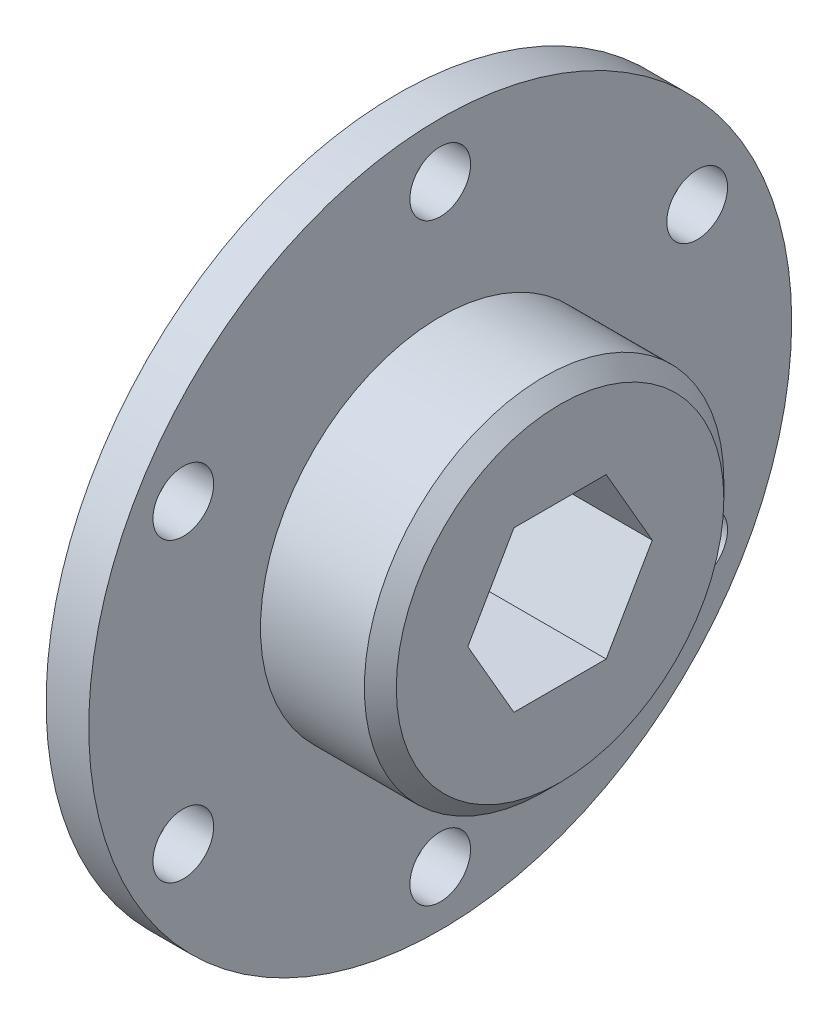
ISO-10303-21;
HEADER;
FILE_DESCRIPTION(('STEP AP214'),'2;1');
FILE_NAME('part.step','',(''),(''),'','','');
FILE_SCHEMA(('AUTOMOTIVE_DESIGN { 1 0 10303 214 1 1 1 1 }'));
ENDSEC;
DATA;
#1=APPLICATION_CONTEXT('core data for automotive mechanical design processes');
#2=APPLICATION_PROTOCOL_DEFINITION('international standard','automotive_design',2000,#1);
#3=PRODUCT_CONTEXT('',#1,'mechanical');
#4=PRODUCT('Part','Part','',(#3));
#5=PRODUCT_RELATED_PRODUCT_CATEGORY('part','',(#4));
#6=PRODUCT_DEFINITION_FORMATION('','',#4);
#7=PRODUCT_DEFINITION_CONTEXT('part definition',#1,'design');
#8=PRODUCT_DEFINITION('design','',#6,#7);
#9=PRODUCT_DEFINITION_SHAPE('','',#8);
#10=(LENGTH_UNIT() NAMED_UNIT(*) SI_UNIT(.MILLI.,.METRE.));
#11=(NAMED_UNIT(*) PLANE_ANGLE_UNIT() SI_UNIT($,.RADIAN.));
#12=(NAMED_UNIT(*) SI_UNIT($,.STERADIAN.) SOLID_ANGLE_UNIT());
#13=UNCERTAINTY_MEASURE_WITH_UNIT(LENGTH_MEASURE(1.E-05),#10,'distance_accuracy_value','');
#14=(GEOMETRIC_REPRESENTATION_CONTEXT(3) GLOBAL_UNCERTAINTY_ASSIGNED_CONTEXT((#13)) GLOBAL_UNIT_ASSIGNED_CONTEXT((#10,
#11,#12)) REPRESENTATION_CONTEXT('',''));
#15=CARTESIAN_POINT('',(0.,0.,0.));
#16=DIRECTION('',(0.,0.,1.));
#17=DIRECTION('',(1.,0.,0.));
#18=AXIS2_PLACEMENT_3D('',#15,#16,#17);
#19=CARTESIAN_POINT('',(3.3909,0.,0.));
#20=DIRECTION('',(1.,0.,0.));
#21=DIRECTION('',(0.,0.,-1.));
#22=AXIS2_PLACEMENT_3D('',#19,#20,#21);
#23=PLANE('',#22);
#24=CARTESIAN_POINT('',(3.3909,11.7919499999988,20.4242565203112));
#25=DIRECTION('',(1.,0.,0.));
#26=DIRECTION('',(0.,0.,-1.));
#27=AXIS2_PLACEMENT_3D('',#24,#25,#26);
#28=CIRCLE('',#27,2.41300000000126);
#29=CARTESIAN_POINT('',(3.3909,11.7919499999988,18.0112565203099));
#30=VERTEX_POINT('',#29);
#31=EDGE_CURVE('E145',#30,#30,#28,.T.);
#32=ORIENTED_EDGE('',*,*,#31,.F.);
#33=EDGE_LOOP('',(#32));
#34=FACE_BOUND('',#33,.T.);
#35=CARTESIAN_POINT('',(3.3909,-23.5839,-2.67542252552879E-12));
#36=DIRECTION('',(1.,0.,0.));
#37=DIRECTION('',(0.,0.,-1.));
#38=AXIS2_PLACEMENT_3D('',#35,#36,#37);
#39=CIRCLE('',#38,2.41300000000272);
#40=CARTESIAN_POINT('',(3.3909,-23.5839,-2.41300000000539));
#41=VERTEX_POINT('',#40);
#42=EDGE_CURVE('E157',#41,#41,#39,.T.);
#43=ORIENTED_EDGE('',*,*,#42,.F.);
#44=EDGE_LOOP('',(#43));
#45=FACE_BOUND('',#44,.T.);
#46=CARTESIAN_POINT('',(3.3909,11.7919500000012,-20.4242565203125));
#47=DIRECTION('',(1.,0.,0.));
#48=DIRECTION('',(0.,0.,-1.));
#49=AXIS2_PLACEMENT_3D('',#46,#47,#48);
#50=CIRCLE('',#49,2.41300000000036);
#51=CARTESIAN_POINT('',(3.3909,11.7919500000012,-22.8372565203129));
#52=VERTEX_POINT('',#51);
#53=EDGE_CURVE('E169',#52,#52,#50,.T.);
#54=ORIENTED_EDGE('',*,*,#53,.F.);
#55=EDGE_LOOP('',(#54));
#56=FACE_BOUND('',#55,.T.);
#57=CARTESIAN_POINT('',(3.3909,0.,0.));
#58=DIRECTION('',(1.,0.,0.));
#59=DIRECTION('',(0.,0.,-1.));
#60=AXIS2_PLACEMENT_3D('',#57,#58,#59);
#61=CIRCLE('',#60,27.94);
#62=CARTESIAN_POINT('',(3.3909,0.,-27.94));
#63=VERTEX_POINT('',#62);
#64=EDGE_CURVE('E214',#63,#63,#61,.T.);
#65=ORIENTED_EDGE('',*,*,#64,.T.);
#66=EDGE_LOOP('',(#65));
#67=FACE_BOUND('',#66,.T.);
#68=CARTESIAN_POINT('',(3.3909,23.5839,0.));
#69=DIRECTION('',(1.,0.,0.));
#70=DIRECTION('',(0.,0.,-1.));
#71=AXIS2_PLACEMENT_3D('',#68,#69,#70);
#72=CIRCLE('',#71,2.413);
#73=CARTESIAN_POINT('',(3.3909,23.5839,-2.413));
#74=VERTEX_POINT('',#73);
#75=EDGE_CURVE('E177',#74,#74,#72,.T.);
#76=ORIENTED_EDGE('',*,*,#75,.F.);
#77=EDGE_LOOP('',(#76));
#78=FACE_BOUND('',#77,.T.);
#79=CARTESIAN_POINT('',(3.3909,-11.7919499999988,-20.4242565203138));
#80=DIRECTION('',(1.,0.,0.));
#81=DIRECTION('',(0.,0.,-1.));
#82=AXIS2_PLACEMENT_3D('',#79,#80,#81);
#83=CIRCLE('',#82,2.41300000000169);
#84=CARTESIAN_POINT('',(3.3909,-11.7919499999988,-22.8372565203155));
#85=VERTEX_POINT('',#84);
#86=EDGE_CURVE('E163',#85,#85,#83,.T.);
#87=ORIENTED_EDGE('',*,*,#86,.F.);
#88=EDGE_LOOP('',(#87));
#89=FACE_BOUND('',#88,.T.);
#90=CARTESIAN_POINT('',(3.3909,-11.7919500000012,20.4242565203098));
#91=DIRECTION('',(1.,0.,0.));
#92=DIRECTION('',(0.,0.,-1.));
#93=AXIS2_PLACEMENT_3D('',#90,#91,#92);
#94=CIRCLE('',#93,2.41300000000248);
#95=CARTESIAN_POINT('',(3.3909,-11.7919500000012,18.0112565203073));
#96=VERTEX_POINT('',#95);
#97=EDGE_CURVE('E151',#96,#96,#94,.T.);
#98=ORIENTED_EDGE('',*,*,#97,.F.);
#99=EDGE_LOOP('',(#98));
#100=FACE_BOUND('',#99,.T.);
#101=CARTESIAN_POINT('',(3.3909,0.,0.));
#102=DIRECTION('',(1.,0.,0.));
#103=DIRECTION('',(0.,0.,-1.));
#104=AXIS2_PLACEMENT_3D('',#101,#102,#103);
#105=CIRCLE('',#104,14.2875);
#106=CARTESIAN_POINT('',(3.3909,0.,-14.2875));
#107=VERTEX_POINT('',#106);
#108=EDGE_CURVE('E140',#107,#107,#105,.T.);
#109=ORIENTED_EDGE('',*,*,#108,.F.);
#110=EDGE_LOOP('',(#109));
#111=FACE_BOUND('',#110,.T.);
#112=ADVANCED_FACE('F38',(#34,#45,#56,#67,#78,#89,#100,#111),#23,.T.);
#113=CARTESIAN_POINT('',(0.,0.,0.));
#114=DIRECTION('',(1.,0.,0.));
#115=DIRECTION('',(0.,0.,-1.));
#116=AXIS2_PLACEMENT_3D('',#113,#114,#115);
#117=PLANE('',#116);
#118=CARTESIAN_POINT('',(0.,0.,0.));
#119=DIRECTION('',(1.,0.,0.));
#120=DIRECTION('',(0.,0.,-1.));
#121=AXIS2_PLACEMENT_3D('',#118,#119,#120);
#122=CIRCLE('',#121,27.94);
#123=CARTESIAN_POINT('',(0.,0.,-27.94));
#124=VERTEX_POINT('',#123);
#125=EDGE_CURVE('E213',#124,#124,#122,.T.);
#126=ORIENTED_EDGE('',*,*,#125,.F.);
#127=EDGE_LOOP('',(#126));
#128=FACE_BOUND('',#127,.T.);
#129=DIRECTION('',(0.,0.866025403784439,-0.5));
#130=VECTOR('',#129,1.);
#131=CARTESIAN_POINT('',(0.,-6.35,-3.66617420935413));
#132=LINE('',#131,#130);
#133=CARTESIAN_POINT('',(0.,-6.35,-3.66617420935413));
#134=VERTEX_POINT('',#133);
#135=CARTESIAN_POINT('',(0.,0.,-7.33234841870825));
#136=VERTEX_POINT('',#135);
#137=EDGE_CURVE('E54',#134,#136,#132,.T.);
#138=ORIENTED_EDGE('',*,*,#137,.T.);
#139=DIRECTION('',(0.,0.866025403784439,0.5));
#140=VECTOR('',#139,1.);
#141=CARTESIAN_POINT('',(0.,0.,-7.33234841870825));
#142=LINE('',#141,#140);
#143=CARTESIAN_POINT('',(0.,6.35000000000001,-3.66617420935412));
#144=VERTEX_POINT('',#143);
#145=EDGE_CURVE('E184',#136,#144,#142,.T.);
#146=ORIENTED_EDGE('',*,*,#145,.T.);
#147=DIRECTION('',(0.,0.,1.));
#148=VECTOR('',#147,1.);
#149=CARTESIAN_POINT('',(0.,6.35000000000001,-3.66617420935412));
#150=LINE('',#149,#148);
#151=CARTESIAN_POINT('',(0.,6.35000000000001,3.66617420935413));
#152=VERTEX_POINT('',#151);
#153=EDGE_CURVE('E188',#144,#152,#150,.T.);
#154=ORIENTED_EDGE('',*,*,#153,.T.);
#155=DIRECTION('',(0.,-0.866025403784439,0.5));
#156=VECTOR('',#155,1.);
#157=CARTESIAN_POINT('',(0.,6.35000000000001,3.66617420935413));
#158=LINE('',#157,#156);
#159=CARTESIAN_POINT('',(0.,0.,7.33234841870825));
#160=VERTEX_POINT('',#159);
#161=EDGE_CURVE('E192',#152,#160,#158,.T.);
#162=ORIENTED_EDGE('',*,*,#161,.T.);
#163=DIRECTION('',(0.,-0.866025403784439,-0.5));
#164=VECTOR('',#163,1.);
#165=CARTESIAN_POINT('',(0.,0.,7.33234841870825));
#166=LINE('',#165,#164);
#167=CARTESIAN_POINT('',(0.,-6.35000000000001,3.66617420935412));
#168=VERTEX_POINT('',#167);
#169=EDGE_CURVE('E196',#160,#168,#166,.T.);
#170=ORIENTED_EDGE('',*,*,#169,.T.);
#171=DIRECTION('',(0.,0.,-1.));
#172=VECTOR('',#171,1.);
#173=CARTESIAN_POINT('',(0.,-6.35000000000001,3.66617420935412));
#174=LINE('',#173,#172);
#175=EDGE_CURVE('E109',#168,#134,#174,.T.);
#176=ORIENTED_EDGE('',*,*,#175,.T.);
#177=EDGE_LOOP('',(#138,#146,#154,#162,#170,#176));
#178=FACE_BOUND('',#177,.T.);
#179=CARTESIAN_POINT('',(0.,23.5839,0.));
#180=DIRECTION('',(1.,0.,0.));
#181=DIRECTION('',(0.,0.,-1.));
#182=AXIS2_PLACEMENT_3D('',#179,#180,#181);
#183=CIRCLE('',#182,2.413);
#184=CARTESIAN_POINT('',(0.,23.5839,-2.413));
#185=VERTEX_POINT('',#184);
#186=EDGE_CURVE('E173',#185,#185,#183,.T.);
#187=ORIENTED_EDGE('',*,*,#186,.T.);
#188=EDGE_LOOP('',(#187));
#189=FACE_BOUND('',#188,.T.);
#190=CARTESIAN_POINT('',(0.,11.7919500000012,-20.4242565203125));
#191=DIRECTION('',(1.,0.,0.));
#192=DIRECTION('',(0.,0.,-1.));
#193=AXIS2_PLACEMENT_3D('',#190,#191,#192);
#194=CIRCLE('',#193,2.41300000000036);
#195=CARTESIAN_POINT('',(0.,11.7919500000012,-22.8372565203129));
#196=VERTEX_POINT('',#195);
#197=EDGE_CURVE('E166',#196,#196,#194,.T.);
#198=ORIENTED_EDGE('',*,*,#197,.T.);
#199=EDGE_LOOP('',(#198));
#200=FACE_BOUND('',#199,.T.);
#201=CARTESIAN_POINT('',(0.,-11.7919499999988,-20.4242565203138));
#202=DIRECTION('',(1.,0.,0.));
#203=DIRECTION('',(0.,0.,-1.));
#204=AXIS2_PLACEMENT_3D('',#201,#202,#203);
#205=CIRCLE('',#204,2.41300000000169);
#206=CARTESIAN_POINT('',(0.,-11.7919499999988,-22.8372565203155));
#207=VERTEX_POINT('',#206);
#208=EDGE_CURVE('E160',#207,#207,#205,.T.);
#209=ORIENTED_EDGE('',*,*,#208,.T.);
#210=EDGE_LOOP('',(#209));
#211=FACE_BOUND('',#210,.T.);
#212=CARTESIAN_POINT('',(0.,-23.5839,-2.67542252552879E-12));
#213=DIRECTION('',(1.,0.,0.));
#214=DIRECTION('',(0.,0.,-1.));
#215=AXIS2_PLACEMENT_3D('',#212,#213,#214);
#216=CIRCLE('',#215,2.41300000000272);
#217=CARTESIAN_POINT('',(0.,-23.5839,-2.41300000000539));
#218=VERTEX_POINT('',#217);
#219=EDGE_CURVE('E154',#218,#218,#216,.T.);
#220=ORIENTED_EDGE('',*,*,#219,.T.);
#221=EDGE_LOOP('',(#220));
#222=FACE_BOUND('',#221,.T.);
#223=CARTESIAN_POINT('',(0.,-11.7919500000012,20.4242565203098));
#224=DIRECTION('',(1.,0.,0.));
#225=DIRECTION('',(0.,0.,-1.));
#226=AXIS2_PLACEMENT_3D('',#223,#224,#225);
#227=CIRCLE('',#226,2.41300000000248);
#228=CARTESIAN_POINT('',(0.,-11.7919500000012,18.0112565203073));
#229=VERTEX_POINT('',#228);
#230=EDGE_CURVE('E148',#229,#229,#227,.T.);
#231=ORIENTED_EDGE('',*,*,#230,.T.);
#232=EDGE_LOOP('',(#231));
#233=FACE_BOUND('',#232,.T.);
#234=CARTESIAN_POINT('',(0.,11.7919499999988,20.4242565203112));
#235=DIRECTION('',(1.,0.,0.));
#236=DIRECTION('',(0.,0.,-1.));
#237=AXIS2_PLACEMENT_3D('',#234,#235,#236);
#238=CIRCLE('',#237,2.41300000000126);
#239=CARTESIAN_POINT('',(0.,11.7919499999988,18.0112565203099));
#240=VERTEX_POINT('',#239);
#241=EDGE_CURVE('E144',#240,#240,#238,.T.);
#242=ORIENTED_EDGE('',*,*,#241,.T.);
#243=EDGE_LOOP('',(#242));
#244=FACE_BOUND('',#243,.T.);
#245=ADVANCED_FACE('F235',(#128,#178,#189,#200,#211,#222,#233,#244),#117,.F.);
#246=CARTESIAN_POINT('',(3.3909,0.,0.));
#247=DIRECTION('',(-1.,0.,0.));
#248=DIRECTION('',(0.,0.,1.));
#249=AXIS2_PLACEMENT_3D('',#246,#247,#248);
#250=CYLINDRICAL_SURFACE('',#249,27.94);
#251=ORIENTED_EDGE('',*,*,#64,.F.);
#252=EDGE_LOOP('',(#251));
#253=FACE_BOUND('',#252,.T.);
#254=ORIENTED_EDGE('',*,*,#125,.T.);
#255=EDGE_LOOP('',(#254));
#256=FACE_BOUND('',#255,.T.);
#257=ADVANCED_FACE('F241',(#253,#256),#250,.T.);
#258=CARTESIAN_POINT('',(3.3909,-6.35,-3.66617420935413));
#259=DIRECTION('',(0.,0.5,0.866025403784439));
#260=DIRECTION('',(0.,-0.866025403784439,0.5));
#261=AXIS2_PLACEMENT_3D('',#258,#259,#260);
#262=PLANE('',#261);
#263=ORIENTED_EDGE('',*,*,#137,.F.);
#264=DIRECTION('',(-1.,0.,0.));
#265=VECTOR('',#264,1.);
#266=CARTESIAN_POINT('',(3.3909,-6.35,-3.66617420935413));
#267=LINE('',#266,#265);
#268=CARTESIAN_POINT('',(12.9159,-6.35,-3.66617420935413));
#269=VERTEX_POINT('',#268);
#270=EDGE_CURVE('E101',#269,#134,#267,.T.);
#271=ORIENTED_EDGE('',*,*,#270,.F.);
#272=DIRECTION('',(0.,0.866025403784439,-0.5));
#273=VECTOR('',#272,1.);
#274=CARTESIAN_POINT('',(12.9159,-6.35,-3.66617420935413));
#275=LINE('',#274,#273);
#276=CARTESIAN_POINT('',(12.9159,0.,-7.33234841870825));
#277=VERTEX_POINT('',#276);
#278=EDGE_CURVE('E105',#269,#277,#275,.T.);
#279=ORIENTED_EDGE('',*,*,#278,.T.);
#280=DIRECTION('',(-1.,0.,0.));
#281=VECTOR('',#280,1.);
#282=CARTESIAN_POINT('',(3.3909,0.,-7.33234841870825));
#283=LINE('',#282,#281);
#284=EDGE_CURVE('E211',#277,#136,#283,.T.);
#285=ORIENTED_EDGE('',*,*,#284,.T.);
#286=EDGE_LOOP('',(#263,#271,#279,#285));
#287=FACE_BOUND('',#286,.T.);
#288=ADVANCED_FACE('F103',(#287),#262,.T.);
#289=CARTESIAN_POINT('',(3.3909,0.,-7.33234841870825));
#290=DIRECTION('',(0.,-0.5,0.866025403784439));
#291=DIRECTION('',(0.,-0.866025403784439,-0.5));
#292=AXIS2_PLACEMENT_3D('',#289,#290,#291);
#293=PLANE('',#292);
#294=ORIENTED_EDGE('',*,*,#145,.F.);
#295=ORIENTED_EDGE('',*,*,#284,.F.);
#296=DIRECTION('',(0.,0.866025403784439,0.5));
#297=VECTOR('',#296,1.);
#298=CARTESIAN_POINT('',(12.9159,0.,-7.33234841870825));
#299=LINE('',#298,#297);
#300=CARTESIAN_POINT('',(12.9159,6.35000000000001,-3.66617420935412));
#301=VERTEX_POINT('',#300);
#302=EDGE_CURVE('E121',#277,#301,#299,.T.);
#303=ORIENTED_EDGE('',*,*,#302,.T.);
#304=DIRECTION('',(-1.,0.,0.));
#305=VECTOR('',#304,1.);
#306=CARTESIAN_POINT('',(3.3909,6.35000000000001,-3.66617420935412));
#307=LINE('',#306,#305);
#308=EDGE_CURVE('E209',#301,#144,#307,.T.);
#309=ORIENTED_EDGE('',*,*,#308,.T.);
#310=EDGE_LOOP('',(#294,#295,#303,#309));
#311=FACE_BOUND('',#310,.T.);
#312=ADVANCED_FACE('F253',(#311),#293,.T.);
#313=CARTESIAN_POINT('',(3.3909,6.35000000000001,-3.66617420935412));
#314=DIRECTION('',(0.,-1.,0.));
#315=DIRECTION('',(0.,0.,-1.));
#316=AXIS2_PLACEMENT_3D('',#313,#314,#315);
#317=PLANE('',#316);
#318=ORIENTED_EDGE('',*,*,#153,.F.);
#319=ORIENTED_EDGE('',*,*,#308,.F.);
#320=DIRECTION('',(0.,0.,1.));
#321=VECTOR('',#320,1.);
#322=CARTESIAN_POINT('',(12.9159,6.35000000000001,-3.66617420935412));
#323=LINE('',#322,#321);
#324=CARTESIAN_POINT('',(12.9159,6.35000000000001,3.66617420935413));
#325=VERTEX_POINT('',#324);
#326=EDGE_CURVE('E127',#301,#325,#323,.T.);
#327=ORIENTED_EDGE('',*,*,#326,.T.);
#328=DIRECTION('',(-1.,0.,0.));
#329=VECTOR('',#328,1.);
#330=CARTESIAN_POINT('',(3.3909,6.35000000000001,3.66617420935413));
#331=LINE('',#330,#329);
#332=EDGE_CURVE('E206',#325,#152,#331,.T.);
#333=ORIENTED_EDGE('',*,*,#332,.T.);
#334=EDGE_LOOP('',(#318,#319,#327,#333));
#335=FACE_BOUND('',#334,.T.);
#336=ADVANCED_FACE('F308',(#335),#317,.T.);
#337=CARTESIAN_POINT('',(3.3909,6.35000000000001,3.66617420935413));
#338=DIRECTION('',(0.,-0.5,-0.866025403784439));
#339=DIRECTION('',(0.,0.866025403784439,-0.5));
#340=AXIS2_PLACEMENT_3D('',#337,#338,#339);
#341=PLANE('',#340);
#342=ORIENTED_EDGE('',*,*,#161,.F.);
#343=ORIENTED_EDGE('',*,*,#332,.F.);
#344=DIRECTION('',(0.,-0.866025403784439,0.5));
#345=VECTOR('',#344,1.);
#346=CARTESIAN_POINT('',(12.9159,6.35000000000001,3.66617420935413));
#347=LINE('',#346,#345);
#348=CARTESIAN_POINT('',(12.9159,0.,7.33234841870825));
#349=VERTEX_POINT('',#348);
#350=EDGE_CURVE('E133',#325,#349,#347,.T.);
#351=ORIENTED_EDGE('',*,*,#350,.T.);
#352=DIRECTION('',(-1.,0.,0.));
#353=VECTOR('',#352,1.);
#354=CARTESIAN_POINT('',(3.3909,0.,7.33234841870825));
#355=LINE('',#354,#353);
#356=EDGE_CURVE('E203',#349,#160,#355,.T.);
#357=ORIENTED_EDGE('',*,*,#356,.T.);
#358=EDGE_LOOP('',(#342,#343,#351,#357));
#359=FACE_BOUND('',#358,.T.);
#360=ADVANCED_FACE('F305',(#359),#341,.T.);
#361=CARTESIAN_POINT('',(3.3909,0.,7.33234841870825));
#362=DIRECTION('',(0.,0.5,-0.866025403784439));
#363=DIRECTION('',(0.,0.866025403784439,0.5));
#364=AXIS2_PLACEMENT_3D('',#361,#362,#363);
#365=PLANE('',#364);
#366=ORIENTED_EDGE('',*,*,#169,.F.);
#367=ORIENTED_EDGE('',*,*,#356,.F.);
#368=DIRECTION('',(0.,-0.866025403784439,-0.5));
#369=VECTOR('',#368,1.);
#370=CARTESIAN_POINT('',(12.9159,0.,7.33234841870825));
#371=LINE('',#370,#369);
#372=CARTESIAN_POINT('',(12.9159,-6.35000000000001,3.66617420935412));
#373=VERTEX_POINT('',#372);
#374=EDGE_CURVE('E137',#349,#373,#371,.T.);
#375=ORIENTED_EDGE('',*,*,#374,.T.);
#376=DIRECTION('',(-1.,0.,0.));
#377=VECTOR('',#376,1.);
#378=CARTESIAN_POINT('',(3.3909,-6.35000000000001,3.66617420935412));
#379=LINE('',#378,#377);
#380=EDGE_CURVE('E62',#373,#168,#379,.T.);
#381=ORIENTED_EDGE('',*,*,#380,.T.);
#382=EDGE_LOOP('',(#366,#367,#375,#381));
#383=FACE_BOUND('',#382,.T.);
#384=ADVANCED_FACE('F302',(#383),#365,.T.);
#385=CARTESIAN_POINT('',(3.3909,-6.35000000000001,3.66617420935412));
#386=DIRECTION('',(0.,1.,0.));
#387=DIRECTION('',(0.,0.,1.));
#388=AXIS2_PLACEMENT_3D('',#385,#386,#387);
#389=PLANE('',#388);
#390=ORIENTED_EDGE('',*,*,#175,.F.);
#391=ORIENTED_EDGE('',*,*,#380,.F.);
#392=DIRECTION('',(0.,0.,-1.));
#393=VECTOR('',#392,1.);
#394=CARTESIAN_POINT('',(12.9159,-6.35000000000001,3.66617420935412));
#395=LINE('',#394,#393);
#396=EDGE_CURVE('E112',#373,#269,#395,.T.);
#397=ORIENTED_EDGE('',*,*,#396,.T.);
#398=ORIENTED_EDGE('',*,*,#270,.T.);
#399=EDGE_LOOP('',(#390,#391,#397,#398));
#400=FACE_BOUND('',#399,.T.);
#401=ADVANCED_FACE('F113',(#400),#389,.T.);
#402=CARTESIAN_POINT('',(3.3909,23.5839,0.));
#403=DIRECTION('',(-1.,0.,0.));
#404=DIRECTION('',(0.,0.,1.));
#405=AXIS2_PLACEMENT_3D('',#402,#403,#404);
#406=CYLINDRICAL_SURFACE('',#405,2.413);
#407=ORIENTED_EDGE('',*,*,#75,.T.);
#408=EDGE_LOOP('',(#407));
#409=FACE_BOUND('',#408,.T.);
#410=ORIENTED_EDGE('',*,*,#186,.F.);
#411=EDGE_LOOP('',(#410));
#412=FACE_BOUND('',#411,.T.);
#413=ADVANCED_FACE('F295',(#409,#412),#406,.F.);
#414=CARTESIAN_POINT('',(3.3909,11.7919500000012,-20.4242565203125));
#415=DIRECTION('',(-1.,0.,0.));
#416=DIRECTION('',(0.,0.,1.));
#417=AXIS2_PLACEMENT_3D('',#414,#415,#416);
#418=CYLINDRICAL_SURFACE('',#417,2.41300000000036);
#419=ORIENTED_EDGE('',*,*,#53,.T.);
#420=EDGE_LOOP('',(#419));
#421=FACE_BOUND('',#420,.T.);
#422=ORIENTED_EDGE('',*,*,#197,.F.);
#423=EDGE_LOOP('',(#422));
#424=FACE_BOUND('',#423,.T.);
#425=ADVANCED_FACE('F291',(#421,#424),#418,.F.);
#426=CARTESIAN_POINT('',(3.3909,-11.7919499999988,-20.4242565203138));
#427=DIRECTION('',(-1.,0.,0.));
#428=DIRECTION('',(0.,0.,1.));
#429=AXIS2_PLACEMENT_3D('',#426,#427,#428);
#430=CYLINDRICAL_SURFACE('',#429,2.41300000000169);
#431=ORIENTED_EDGE('',*,*,#86,.T.);
#432=EDGE_LOOP('',(#431));
#433=FACE_BOUND('',#432,.T.);
#434=ORIENTED_EDGE('',*,*,#208,.F.);
#435=EDGE_LOOP('',(#434));
#436=FACE_BOUND('',#435,.T.);
#437=ADVANCED_FACE('F287',(#433,#436),#430,.F.);
#438=CARTESIAN_POINT('',(3.3909,-23.5839,-2.67542252552879E-12));
#439=DIRECTION('',(-1.,0.,0.));
#440=DIRECTION('',(0.,0.,1.));
#441=AXIS2_PLACEMENT_3D('',#438,#439,#440);
#442=CYLINDRICAL_SURFACE('',#441,2.41300000000272);
#443=ORIENTED_EDGE('',*,*,#42,.T.);
#444=EDGE_LOOP('',(#443));
#445=FACE_BOUND('',#444,.T.);
#446=ORIENTED_EDGE('',*,*,#219,.F.);
#447=EDGE_LOOP('',(#446));
#448=FACE_BOUND('',#447,.T.);
#449=ADVANCED_FACE('F281',(#445,#448),#442,.F.);
#450=CARTESIAN_POINT('',(3.3909,-11.7919500000012,20.4242565203098));
#451=DIRECTION('',(-1.,0.,0.));
#452=DIRECTION('',(0.,0.,1.));
#453=AXIS2_PLACEMENT_3D('',#450,#451,#452);
#454=CYLINDRICAL_SURFACE('',#453,2.41300000000248);
#455=ORIENTED_EDGE('',*,*,#97,.T.);
#456=EDGE_LOOP('',(#455));
#457=FACE_BOUND('',#456,.T.);
#458=ORIENTED_EDGE('',*,*,#230,.F.);
#459=EDGE_LOOP('',(#458));
#460=FACE_BOUND('',#459,.T.);
#461=ADVANCED_FACE('F273',(#457,#460),#454,.F.);
#462=CARTESIAN_POINT('',(3.3909,11.7919499999988,20.4242565203112));
#463=DIRECTION('',(-1.,0.,0.));
#464=DIRECTION('',(0.,0.,1.));
#465=AXIS2_PLACEMENT_3D('',#462,#463,#464);
#466=CYLINDRICAL_SURFACE('',#465,2.41300000000126);
#467=ORIENTED_EDGE('',*,*,#31,.T.);
#468=EDGE_LOOP('',(#467));
#469=FACE_BOUND('',#468,.T.);
#470=ORIENTED_EDGE('',*,*,#241,.F.);
#471=EDGE_LOOP('',(#470));
#472=FACE_BOUND('',#471,.T.);
#473=ADVANCED_FACE('F271',(#469,#472),#466,.F.);
#474=CARTESIAN_POINT('',(12.9159,0.,0.));
#475=DIRECTION('',(1.,0.,0.));
#476=DIRECTION('',(0.,0.,-1.));
#477=AXIS2_PLACEMENT_3D('',#474,#475,#476);
#478=PLANE('',#477);
#479=CARTESIAN_POINT('',(12.9159,0.,0.));
#480=DIRECTION('',(1.,0.,0.));
#481=DIRECTION('',(0.,0.,-1.));
#482=AXIS2_PLACEMENT_3D('',#479,#480,#481);
#483=CIRCLE('',#482,13.0175);
#484=CARTESIAN_POINT('',(12.9159,0.,-13.0175));
#485=VERTEX_POINT('',#484);
#486=EDGE_CURVE('E47',#485,#485,#483,.T.);
#487=ORIENTED_EDGE('',*,*,#486,.T.);
#488=EDGE_LOOP('',(#487));
#489=FACE_BOUND('',#488,.T.);
#490=ORIENTED_EDGE('',*,*,#278,.F.);
#491=ORIENTED_EDGE('',*,*,#396,.F.);
#492=ORIENTED_EDGE('',*,*,#374,.F.);
#493=ORIENTED_EDGE('',*,*,#350,.F.);
#494=ORIENTED_EDGE('',*,*,#326,.F.);
#495=ORIENTED_EDGE('',*,*,#302,.F.);
#496=EDGE_LOOP('',(#490,#491,#492,#493,#494,#495));
#497=FACE_BOUND('',#496,.T.);
#498=ADVANCED_FACE('F118',(#489,#497),#478,.T.);
#499=CARTESIAN_POINT('',(12.9159,0.,0.));
#500=DIRECTION('',(-1.,0.,0.));
#501=DIRECTION('',(0.,0.,1.));
#502=AXIS2_PLACEMENT_3D('',#499,#500,#501);
#503=CYLINDRICAL_SURFACE('',#502,14.2875);
#504=CARTESIAN_POINT('',(11.6459,0.,0.));
#505=DIRECTION('',(1.,0.,0.));
#506=DIRECTION('',(0.,0.,-1.));
#507=AXIS2_PLACEMENT_3D('',#504,#505,#506);
#508=CIRCLE('',#507,14.2875);
#509=CARTESIAN_POINT('',(11.6459,0.,-14.2875));
#510=VERTEX_POINT('',#509);
#511=EDGE_CURVE('E11',#510,#510,#508,.F.);
#512=ORIENTED_EDGE('',*,*,#511,.T.);
#513=EDGE_LOOP('',(#512));
#514=FACE_BOUND('',#513,.T.);
#515=ORIENTED_EDGE('',*,*,#108,.T.);
#516=EDGE_LOOP('',(#515));
#517=FACE_BOUND('',#516,.T.);
#518=ADVANCED_FACE('F226',(#514,#517),#503,.T.);
#519=CARTESIAN_POINT('',(12.9159,0.,0.));
#520=DIRECTION('',(-1.,0.,0.));
#521=DIRECTION('',(0.,0.,1.));
#522=AXIS2_PLACEMENT_3D('',#519,#520,#521);
#523=CONICAL_SURFACE('',#522,13.0175,0.785398163397448);
#524=ORIENTED_EDGE('',*,*,#511,.F.);
#525=EDGE_LOOP('',(#524));
#526=FACE_BOUND('',#525,.T.);
#527=ORIENTED_EDGE('',*,*,#486,.F.);
#528=EDGE_LOOP('',(#527));
#529=FACE_BOUND('',#528,.T.);
#530=ADVANCED_FACE('F40',(#526,#529),#523,.T.);
#531=CLOSED_SHELL('',(#112,#245,#257,#288,#312,#336,#360,#384,#401,#413,#425,#437,#449,#461,
#473,#498,#518,#530));
#532=MANIFOLD_SOLID_BREP('B2',#531);
#533=ADVANCED_BREP_SHAPE_REPRESENTATION('',(#18,#532),#14);
#534=SHAPE_DEFINITION_REPRESENTATION(#9,#533);
ENDSEC;
END-ISO-10303-21;
